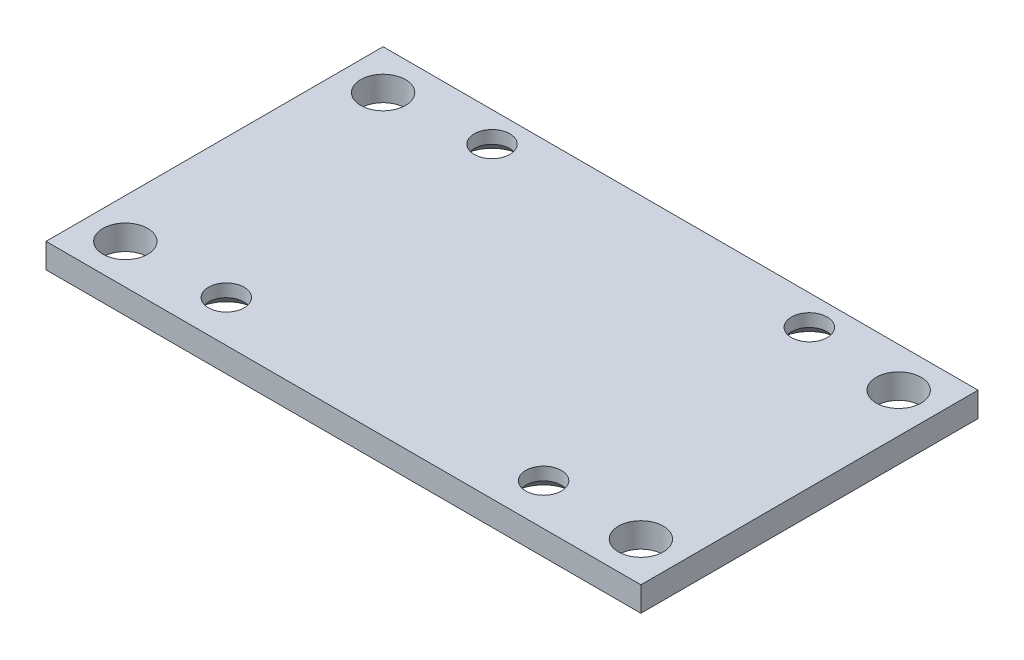
ISO-10303-21;
HEADER;
FILE_DESCRIPTION(('STEP AP214'),'2;1');
FILE_NAME('part.step','',(''),(''),'','','');
FILE_SCHEMA(('AUTOMOTIVE_DESIGN { 1 0 10303 214 1 1 1 1 }'));
ENDSEC;
DATA;
#1=APPLICATION_CONTEXT('core data for automotive mechanical design processes');
#2=APPLICATION_PROTOCOL_DEFINITION('international standard','automotive_design',2000,#1);
#3=PRODUCT_CONTEXT('',#1,'mechanical');
#4=PRODUCT('Part','Part','',(#3));
#5=PRODUCT_RELATED_PRODUCT_CATEGORY('part','',(#4));
#6=PRODUCT_DEFINITION_FORMATION('','',#4);
#7=PRODUCT_DEFINITION_CONTEXT('part definition',#1,'design');
#8=PRODUCT_DEFINITION('design','',#6,#7);
#9=PRODUCT_DEFINITION_SHAPE('','',#8);
#10=(LENGTH_UNIT() NAMED_UNIT(*) SI_UNIT(.MILLI.,.METRE.));
#11=(NAMED_UNIT(*) PLANE_ANGLE_UNIT() SI_UNIT($,.RADIAN.));
#12=(NAMED_UNIT(*) SI_UNIT($,.STERADIAN.) SOLID_ANGLE_UNIT());
#13=UNCERTAINTY_MEASURE_WITH_UNIT(LENGTH_MEASURE(1.E-05),#10,'distance_accuracy_value','');
#14=(GEOMETRIC_REPRESENTATION_CONTEXT(3) GLOBAL_UNCERTAINTY_ASSIGNED_CONTEXT((#13)) GLOBAL_UNIT_ASSIGNED_CONTEXT((#10,
#11,#12)) REPRESENTATION_CONTEXT('',''));
#15=CARTESIAN_POINT('',(0.,0.,0.));
#16=DIRECTION('',(0.,0.,1.));
#17=DIRECTION('',(1.,0.,0.));
#18=AXIS2_PLACEMENT_3D('',#15,#16,#17);
#19=CARTESIAN_POINT('',(15.,1.2446,8.5));
#20=DIRECTION('',(-1.,0.,0.));
#21=DIRECTION('',(0.,0.,1.));
#22=AXIS2_PLACEMENT_3D('',#19,#20,#21);
#23=PLANE('',#22);
#24=DIRECTION('',(0.,0.,-1.));
#25=VECTOR('',#24,1.);
#26=CARTESIAN_POINT('',(15.,0.,8.5));
#27=LINE('',#26,#25);
#28=CARTESIAN_POINT('',(15.,0.,8.5));
#29=VERTEX_POINT('',#28);
#30=CARTESIAN_POINT('',(15.,0.,-8.5));
#31=VERTEX_POINT('',#30);
#32=EDGE_CURVE('E98',#29,#31,#27,.T.);
#33=ORIENTED_EDGE('',*,*,#32,.T.);
#34=DIRECTION('',(0.,-1.,0.));
#35=VECTOR('',#34,1.);
#36=CARTESIAN_POINT('',(15.,1.2446,-8.5));
#37=LINE('',#36,#35);
#38=CARTESIAN_POINT('',(15.,1.2446,-8.5));
#39=VERTEX_POINT('',#38);
#40=EDGE_CURVE('E11',#39,#31,#37,.T.);
#41=ORIENTED_EDGE('',*,*,#40,.F.);
#42=DIRECTION('',(0.,0.,-1.));
#43=VECTOR('',#42,1.);
#44=CARTESIAN_POINT('',(15.,1.2446,8.5));
#45=LINE('',#44,#43);
#46=CARTESIAN_POINT('',(15.,1.2446,8.5));
#47=VERTEX_POINT('',#46);
#48=EDGE_CURVE('E85',#47,#39,#45,.T.);
#49=ORIENTED_EDGE('',*,*,#48,.F.);
#50=DIRECTION('',(0.,-1.,0.));
#51=VECTOR('',#50,1.);
#52=CARTESIAN_POINT('',(15.,1.2446,8.5));
#53=LINE('',#52,#51);
#54=EDGE_CURVE('E94',#47,#29,#53,.T.);
#55=ORIENTED_EDGE('',*,*,#54,.T.);
#56=EDGE_LOOP('',(#33,#41,#49,#55));
#57=FACE_BOUND('',#56,.T.);
#58=ADVANCED_FACE('F32',(#57),#23,.F.);
#59=CARTESIAN_POINT('',(-15.,1.2446,-8.5));
#60=DIRECTION('',(0.,0.,1.));
#61=DIRECTION('',(1.,0.,0.));
#62=AXIS2_PLACEMENT_3D('',#59,#60,#61);
#63=PLANE('',#62);
#64=DIRECTION('',(-1.,0.,0.));
#65=VECTOR('',#64,1.);
#66=CARTESIAN_POINT('',(-15.,0.,-8.5));
#67=LINE('',#66,#65);
#68=CARTESIAN_POINT('',(-15.,0.,-8.5));
#69=VERTEX_POINT('',#68);
#70=EDGE_CURVE('E89',#31,#69,#67,.T.);
#71=ORIENTED_EDGE('',*,*,#70,.T.);
#72=DIRECTION('',(0.,-1.,0.));
#73=VECTOR('',#72,1.);
#74=CARTESIAN_POINT('',(-15.,1.2446,-8.5));
#75=LINE('',#74,#73);
#76=CARTESIAN_POINT('',(-15.,1.2446,-8.5));
#77=VERTEX_POINT('',#76);
#78=EDGE_CURVE('E41',#77,#69,#75,.T.);
#79=ORIENTED_EDGE('',*,*,#78,.F.);
#80=DIRECTION('',(-1.,0.,0.));
#81=VECTOR('',#80,1.);
#82=CARTESIAN_POINT('',(-15.,1.2446,-8.5));
#83=LINE('',#82,#81);
#84=EDGE_CURVE('E80',#39,#77,#83,.T.);
#85=ORIENTED_EDGE('',*,*,#84,.F.);
#86=ORIENTED_EDGE('',*,*,#40,.T.);
#87=EDGE_LOOP('',(#71,#79,#85,#86));
#88=FACE_BOUND('',#87,.T.);
#89=ADVANCED_FACE('F88',(#88),#63,.F.);
#90=CARTESIAN_POINT('',(-15.,1.2446,8.5));
#91=DIRECTION('',(1.,0.,0.));
#92=DIRECTION('',(0.,0.,-1.));
#93=AXIS2_PLACEMENT_3D('',#90,#91,#92);
#94=PLANE('',#93);
#95=DIRECTION('',(0.,0.,1.));
#96=VECTOR('',#95,1.);
#97=CARTESIAN_POINT('',(-15.,0.,8.5));
#98=LINE('',#97,#96);
#99=CARTESIAN_POINT('',(-15.,0.,8.5));
#100=VERTEX_POINT('',#99);
#101=EDGE_CURVE('E67',#69,#100,#98,.T.);
#102=ORIENTED_EDGE('',*,*,#101,.T.);
#103=DIRECTION('',(0.,-1.,0.));
#104=VECTOR('',#103,1.);
#105=CARTESIAN_POINT('',(-15.,1.2446,8.5));
#106=LINE('',#105,#104);
#107=CARTESIAN_POINT('',(-15.,1.2446,8.5));
#108=VERTEX_POINT('',#107);
#109=EDGE_CURVE('E90',#108,#100,#106,.T.);
#110=ORIENTED_EDGE('',*,*,#109,.F.);
#111=DIRECTION('',(0.,0.,1.));
#112=VECTOR('',#111,1.);
#113=CARTESIAN_POINT('',(-15.,1.2446,8.5));
#114=LINE('',#113,#112);
#115=EDGE_CURVE('E83',#77,#108,#114,.T.);
#116=ORIENTED_EDGE('',*,*,#115,.F.);
#117=ORIENTED_EDGE('',*,*,#78,.T.);
#118=EDGE_LOOP('',(#102,#110,#116,#117));
#119=FACE_BOUND('',#118,.T.);
#120=ADVANCED_FACE('F92',(#119),#94,.F.);
#121=CARTESIAN_POINT('',(-15.,1.2446,8.5));
#122=DIRECTION('',(0.,0.,-1.));
#123=DIRECTION('',(-1.,0.,0.));
#124=AXIS2_PLACEMENT_3D('',#121,#122,#123);
#125=PLANE('',#124);
#126=DIRECTION('',(1.,0.,0.));
#127=VECTOR('',#126,1.);
#128=CARTESIAN_POINT('',(-15.,0.,8.5));
#129=LINE('',#128,#127);
#130=EDGE_CURVE('E73',#100,#29,#129,.T.);
#131=ORIENTED_EDGE('',*,*,#130,.T.);
#132=ORIENTED_EDGE('',*,*,#54,.F.);
#133=DIRECTION('',(1.,0.,0.));
#134=VECTOR('',#133,1.);
#135=CARTESIAN_POINT('',(-15.,1.2446,8.5));
#136=LINE('',#135,#134);
#137=EDGE_CURVE('E50',#108,#47,#136,.T.);
#138=ORIENTED_EDGE('',*,*,#137,.F.);
#139=ORIENTED_EDGE('',*,*,#109,.T.);
#140=EDGE_LOOP('',(#131,#132,#138,#139));
#141=FACE_BOUND('',#140,.T.);
#142=ADVANCED_FACE('F188',(#141),#125,.F.);
#143=CARTESIAN_POINT('',(15.,1.2446,-8.5));
#144=DIRECTION('',(0.,-1.,0.));
#145=DIRECTION('',(0.,0.,-1.));
#146=AXIS2_PLACEMENT_3D('',#143,#144,#145);
#147=PLANE('',#146);
#148=CARTESIAN_POINT('',(-12.9999999999998,1.2446,-6.50000000000001));
#149=DIRECTION('',(0.,1.,0.));
#150=DIRECTION('',(0.,0.,1.));
#151=AXIS2_PLACEMENT_3D('',#148,#149,#150);
#152=CIRCLE('',#151,1.1303);
#153=CARTESIAN_POINT('',(-12.9999999999998,1.2446,-5.36970000000001));
#154=VERTEX_POINT('',#153);
#155=EDGE_CURVE('E127',#154,#154,#152,.T.);
#156=ORIENTED_EDGE('',*,*,#155,.F.);
#157=EDGE_LOOP('',(#156));
#158=FACE_BOUND('',#157,.T.);
#159=CARTESIAN_POINT('',(-12.9999999999998,1.2446,6.5));
#160=DIRECTION('',(0.,1.,0.));
#161=DIRECTION('',(0.,0.,1.));
#162=AXIS2_PLACEMENT_3D('',#159,#160,#161);
#163=CIRCLE('',#162,1.1303);
#164=CARTESIAN_POINT('',(-12.9999999999998,1.2446,7.6303));
#165=VERTEX_POINT('',#164);
#166=EDGE_CURVE('E117',#165,#165,#163,.T.);
#167=ORIENTED_EDGE('',*,*,#166,.F.);
#168=EDGE_LOOP('',(#167));
#169=FACE_BOUND('',#168,.T.);
#170=CARTESIAN_POINT('',(12.9999999999999,1.2446,-6.5));
#171=DIRECTION('',(0.,1.,0.));
#172=DIRECTION('',(0.,0.,1.));
#173=AXIS2_PLACEMENT_3D('',#170,#171,#172);
#174=CIRCLE('',#173,1.1303);
#175=CARTESIAN_POINT('',(12.9999999999999,1.2446,-5.3697));
#176=VERTEX_POINT('',#175);
#177=EDGE_CURVE('E114',#176,#176,#174,.T.);
#178=ORIENTED_EDGE('',*,*,#177,.F.);
#179=EDGE_LOOP('',(#178));
#180=FACE_BOUND('',#179,.T.);
#181=CARTESIAN_POINT('',(12.9999999999999,1.2446,6.5));
#182=DIRECTION('',(0.,1.,0.));
#183=DIRECTION('',(0.,0.,1.));
#184=AXIS2_PLACEMENT_3D('',#181,#182,#183);
#185=CIRCLE('',#184,1.1303);
#186=CARTESIAN_POINT('',(12.9999999999999,1.2446,7.6303));
#187=VERTEX_POINT('',#186);
#188=EDGE_CURVE('E111',#187,#187,#185,.T.);
#189=ORIENTED_EDGE('',*,*,#188,.F.);
#190=EDGE_LOOP('',(#189));
#191=FACE_BOUND('',#190,.T.);
#192=CARTESIAN_POINT('',(-8.00000000000001,1.2446,6.40710452057659));
#193=DIRECTION('',(0.,-1.,0.));
#194=DIRECTION('',(0.,0.,-1.));
#195=AXIS2_PLACEMENT_3D('',#192,#193,#194);
#196=CIRCLE('',#195,0.9);
#197=CARTESIAN_POINT('',(-8.00000000000001,1.2446,5.50710452057659));
#198=VERTEX_POINT('',#197);
#199=EDGE_CURVE('E137',#198,#198,#196,.T.);
#200=ORIENTED_EDGE('',*,*,#199,.T.);
#201=EDGE_LOOP('',(#200));
#202=FACE_BOUND('',#201,.T.);
#203=CARTESIAN_POINT('',(7.9999999999999,1.2446,6.40710452057659));
#204=DIRECTION('',(0.,-1.,0.));
#205=DIRECTION('',(0.,0.,-1.));
#206=AXIS2_PLACEMENT_3D('',#203,#204,#205);
#207=CIRCLE('',#206,0.9);
#208=CARTESIAN_POINT('',(7.9999999999999,1.2446,5.50710452057659));
#209=VERTEX_POINT('',#208);
#210=EDGE_CURVE('E146',#209,#209,#207,.T.);
#211=ORIENTED_EDGE('',*,*,#210,.T.);
#212=EDGE_LOOP('',(#211));
#213=FACE_BOUND('',#212,.T.);
#214=CARTESIAN_POINT('',(-8.00000000000001,1.2446,-6.99289547942342));
#215=DIRECTION('',(0.,-1.,0.));
#216=DIRECTION('',(0.,0.,-1.));
#217=AXIS2_PLACEMENT_3D('',#214,#215,#216);
#218=CIRCLE('',#217,0.9);
#219=CARTESIAN_POINT('',(-8.00000000000001,1.2446,-7.89289547942342));
#220=VERTEX_POINT('',#219);
#221=EDGE_CURVE('E155',#220,#220,#218,.T.);
#222=ORIENTED_EDGE('',*,*,#221,.T.);
#223=EDGE_LOOP('',(#222));
#224=FACE_BOUND('',#223,.T.);
#225=CARTESIAN_POINT('',(7.9999999999999,1.2446,-6.99289547942342));
#226=DIRECTION('',(0.,-1.,0.));
#227=DIRECTION('',(0.,0.,-1.));
#228=AXIS2_PLACEMENT_3D('',#225,#226,#227);
#229=CIRCLE('',#228,0.9);
#230=CARTESIAN_POINT('',(7.9999999999999,1.2446,-7.89289547942342));
#231=VERTEX_POINT('',#230);
#232=EDGE_CURVE('E101',#231,#231,#229,.T.);
#233=ORIENTED_EDGE('',*,*,#232,.T.);
#234=EDGE_LOOP('',(#233));
#235=FACE_BOUND('',#234,.T.);
#236=ORIENTED_EDGE('',*,*,#48,.T.);
#237=ORIENTED_EDGE('',*,*,#84,.T.);
#238=ORIENTED_EDGE('',*,*,#115,.T.);
#239=ORIENTED_EDGE('',*,*,#137,.T.);
#240=EDGE_LOOP('',(#236,#237,#238,#239));
#241=FACE_BOUND('',#240,.T.);
#242=ADVANCED_FACE('F81',(#158,#169,#180,#191,#202,#213,#224,#235,#241),#147,.F.);
#243=CARTESIAN_POINT('',(15.,0.,-8.5));
#244=DIRECTION('',(0.,-1.,0.));
#245=DIRECTION('',(0.,0.,-1.));
#246=AXIS2_PLACEMENT_3D('',#243,#244,#245);
#247=PLANE('',#246);
#248=CARTESIAN_POINT('',(-12.9999999999998,0.,-6.50000000000001));
#249=DIRECTION('',(0.,-1.,0.));
#250=DIRECTION('',(0.,0.,-1.));
#251=AXIS2_PLACEMENT_3D('',#248,#249,#250);
#252=CIRCLE('',#251,1.1303);
#253=CARTESIAN_POINT('',(-12.9999999999998,0.,-7.6303));
#254=VERTEX_POINT('',#253);
#255=EDGE_CURVE('E35',#254,#254,#252,.T.);
#256=ORIENTED_EDGE('',*,*,#255,.F.);
#257=EDGE_LOOP('',(#256));
#258=FACE_BOUND('',#257,.T.);
#259=CARTESIAN_POINT('',(-12.9999999999998,0.,6.5));
#260=DIRECTION('',(0.,-1.,0.));
#261=DIRECTION('',(0.,0.,-1.));
#262=AXIS2_PLACEMENT_3D('',#259,#260,#261);
#263=CIRCLE('',#262,1.1303);
#264=CARTESIAN_POINT('',(-12.9999999999998,0.,5.3697));
#265=VERTEX_POINT('',#264);
#266=EDGE_CURVE('E115',#265,#265,#263,.T.);
#267=ORIENTED_EDGE('',*,*,#266,.F.);
#268=EDGE_LOOP('',(#267));
#269=FACE_BOUND('',#268,.T.);
#270=CARTESIAN_POINT('',(12.9999999999999,0.,-6.5));
#271=DIRECTION('',(0.,-1.,0.));
#272=DIRECTION('',(0.,0.,-1.));
#273=AXIS2_PLACEMENT_3D('',#270,#271,#272);
#274=CIRCLE('',#273,1.1303);
#275=CARTESIAN_POINT('',(12.9999999999999,0.,-7.6303));
#276=VERTEX_POINT('',#275);
#277=EDGE_CURVE('E112',#276,#276,#274,.T.);
#278=ORIENTED_EDGE('',*,*,#277,.F.);
#279=EDGE_LOOP('',(#278));
#280=FACE_BOUND('',#279,.T.);
#281=CARTESIAN_POINT('',(12.9999999999999,0.,6.5));
#282=DIRECTION('',(0.,-1.,0.));
#283=DIRECTION('',(0.,0.,-1.));
#284=AXIS2_PLACEMENT_3D('',#281,#282,#283);
#285=CIRCLE('',#284,1.1303);
#286=CARTESIAN_POINT('',(12.9999999999999,0.,5.3697));
#287=VERTEX_POINT('',#286);
#288=EDGE_CURVE('E107',#287,#287,#285,.T.);
#289=ORIENTED_EDGE('',*,*,#288,.F.);
#290=EDGE_LOOP('',(#289));
#291=FACE_BOUND('',#290,.T.);
#292=CARTESIAN_POINT('',(-8.00000000000001,0.,6.40710452057659));
#293=DIRECTION('',(0.,-1.,0.));
#294=DIRECTION('',(0.,0.,-1.));
#295=AXIS2_PLACEMENT_3D('',#292,#293,#294);
#296=CIRCLE('',#295,1.5);
#297=CARTESIAN_POINT('',(-8.00000000000001,0.,4.90710452057659));
#298=VERTEX_POINT('',#297);
#299=EDGE_CURVE('E110',#298,#298,#296,.T.);
#300=ORIENTED_EDGE('',*,*,#299,.F.);
#301=EDGE_LOOP('',(#300));
#302=FACE_BOUND('',#301,.T.);
#303=CARTESIAN_POINT('',(7.9999999999999,0.,6.40710452057659));
#304=DIRECTION('',(0.,-1.,0.));
#305=DIRECTION('',(0.,0.,-1.));
#306=AXIS2_PLACEMENT_3D('',#303,#304,#305);
#307=CIRCLE('',#306,1.5);
#308=CARTESIAN_POINT('',(7.9999999999999,0.,4.90710452057659));
#309=VERTEX_POINT('',#308);
#310=EDGE_CURVE('E140',#309,#309,#307,.T.);
#311=ORIENTED_EDGE('',*,*,#310,.F.);
#312=EDGE_LOOP('',(#311));
#313=FACE_BOUND('',#312,.T.);
#314=CARTESIAN_POINT('',(-8.00000000000001,0.,-6.99289547942342));
#315=DIRECTION('',(0.,-1.,0.));
#316=DIRECTION('',(0.,0.,-1.));
#317=AXIS2_PLACEMENT_3D('',#314,#315,#316);
#318=CIRCLE('',#317,1.5);
#319=CARTESIAN_POINT('',(-8.00000000000001,0.,-8.49289547942342));
#320=VERTEX_POINT('',#319);
#321=EDGE_CURVE('E149',#320,#320,#318,.T.);
#322=ORIENTED_EDGE('',*,*,#321,.F.);
#323=EDGE_LOOP('',(#322));
#324=FACE_BOUND('',#323,.T.);
#325=CARTESIAN_POINT('',(7.9999999999999,0.,-6.99289547942342));
#326=DIRECTION('',(0.,-1.,0.));
#327=DIRECTION('',(0.,0.,-1.));
#328=AXIS2_PLACEMENT_3D('',#325,#326,#327);
#329=CIRCLE('',#328,1.5);
#330=CARTESIAN_POINT('',(7.9999999999999,0.,-8.49289547942342));
#331=VERTEX_POINT('',#330);
#332=EDGE_CURVE('E158',#331,#331,#329,.T.);
#333=ORIENTED_EDGE('',*,*,#332,.F.);
#334=EDGE_LOOP('',(#333));
#335=FACE_BOUND('',#334,.T.);
#336=ORIENTED_EDGE('',*,*,#32,.F.);
#337=ORIENTED_EDGE('',*,*,#130,.F.);
#338=ORIENTED_EDGE('',*,*,#101,.F.);
#339=ORIENTED_EDGE('',*,*,#70,.F.);
#340=EDGE_LOOP('',(#336,#337,#338,#339));
#341=FACE_BOUND('',#340,.T.);
#342=ADVANCED_FACE('F172',(#258,#269,#280,#291,#302,#313,#324,#335,#341),#247,.T.);
#343=CARTESIAN_POINT('',(7.9999999999999,0.,-6.99289547942342));
#344=DIRECTION('',(0.,-1.,0.));
#345=DIRECTION('',(0.,0.,-1.));
#346=AXIS2_PLACEMENT_3D('',#343,#344,#345);
#347=CYLINDRICAL_SURFACE('',#346,0.9);
#348=ORIENTED_EDGE('',*,*,#232,.F.);
#349=EDGE_LOOP('',(#348));
#350=FACE_BOUND('',#349,.T.);
#351=CARTESIAN_POINT('',(7.9999999999999,0.599999999999999,-6.99289547942342));
#352=DIRECTION('',(0.,-1.,0.));
#353=DIRECTION('',(0.,0.,-1.));
#354=AXIS2_PLACEMENT_3D('',#351,#352,#353);
#355=CIRCLE('',#354,0.9);
#356=CARTESIAN_POINT('',(7.9999999999999,0.599999999999999,-7.89289547942342));
#357=VERTEX_POINT('',#356);
#358=EDGE_CURVE('E161',#357,#357,#355,.T.);
#359=ORIENTED_EDGE('',*,*,#358,.T.);
#360=EDGE_LOOP('',(#359));
#361=FACE_BOUND('',#360,.T.);
#362=ADVANCED_FACE('F168',(#350,#361),#347,.F.);
#363=CARTESIAN_POINT('',(7.9999999999999,0.,-6.99289547942342));
#364=DIRECTION('',(0.,-1.,0.));
#365=DIRECTION('',(0.,0.,-1.));
#366=AXIS2_PLACEMENT_3D('',#363,#364,#365);
#367=CONICAL_SURFACE('',#366,1.5,0.785398163397449);
#368=ORIENTED_EDGE('',*,*,#358,.F.);
#369=EDGE_LOOP('',(#368));
#370=FACE_BOUND('',#369,.T.);
#371=ORIENTED_EDGE('',*,*,#332,.T.);
#372=EDGE_LOOP('',(#371));
#373=FACE_BOUND('',#372,.T.);
#374=ADVANCED_FACE('F171',(#370,#373),#367,.F.);
#375=CARTESIAN_POINT('',(-8.00000000000001,0.,-6.99289547942342));
#376=DIRECTION('',(0.,-1.,0.));
#377=DIRECTION('',(0.,0.,-1.));
#378=AXIS2_PLACEMENT_3D('',#375,#376,#377);
#379=CYLINDRICAL_SURFACE('',#378,0.9);
#380=ORIENTED_EDGE('',*,*,#221,.F.);
#381=EDGE_LOOP('',(#380));
#382=FACE_BOUND('',#381,.T.);
#383=CARTESIAN_POINT('',(-8.00000000000001,0.599999999999999,-6.99289547942342));
#384=DIRECTION('',(0.,-1.,0.));
#385=DIRECTION('',(0.,0.,-1.));
#386=AXIS2_PLACEMENT_3D('',#383,#384,#385);
#387=CIRCLE('',#386,0.9);
#388=CARTESIAN_POINT('',(-8.00000000000001,0.599999999999999,-7.89289547942342));
#389=VERTEX_POINT('',#388);
#390=EDGE_CURVE('E152',#389,#389,#387,.T.);
#391=ORIENTED_EDGE('',*,*,#390,.T.);
#392=EDGE_LOOP('',(#391));
#393=FACE_BOUND('',#392,.T.);
#394=ADVANCED_FACE('F178',(#382,#393),#379,.F.);
#395=CARTESIAN_POINT('',(-8.00000000000001,0.,-6.99289547942342));
#396=DIRECTION('',(0.,-1.,0.));
#397=DIRECTION('',(0.,0.,-1.));
#398=AXIS2_PLACEMENT_3D('',#395,#396,#397);
#399=CONICAL_SURFACE('',#398,1.5,0.785398163397449);
#400=ORIENTED_EDGE('',*,*,#390,.F.);
#401=EDGE_LOOP('',(#400));
#402=FACE_BOUND('',#401,.T.);
#403=ORIENTED_EDGE('',*,*,#321,.T.);
#404=EDGE_LOOP('',(#403));
#405=FACE_BOUND('',#404,.T.);
#406=ADVANCED_FACE('F235',(#402,#405),#399,.F.);
#407=CARTESIAN_POINT('',(7.9999999999999,0.,6.40710452057659));
#408=DIRECTION('',(0.,-1.,0.));
#409=DIRECTION('',(0.,0.,-1.));
#410=AXIS2_PLACEMENT_3D('',#407,#408,#409);
#411=CYLINDRICAL_SURFACE('',#410,0.9);
#412=ORIENTED_EDGE('',*,*,#210,.F.);
#413=EDGE_LOOP('',(#412));
#414=FACE_BOUND('',#413,.T.);
#415=CARTESIAN_POINT('',(7.9999999999999,0.599999999999999,6.40710452057659));
#416=DIRECTION('',(0.,-1.,0.));
#417=DIRECTION('',(0.,0.,-1.));
#418=AXIS2_PLACEMENT_3D('',#415,#416,#417);
#419=CIRCLE('',#418,0.9);
#420=CARTESIAN_POINT('',(7.9999999999999,0.599999999999999,5.50710452057659));
#421=VERTEX_POINT('',#420);
#422=EDGE_CURVE('E143',#421,#421,#419,.T.);
#423=ORIENTED_EDGE('',*,*,#422,.T.);
#424=EDGE_LOOP('',(#423));
#425=FACE_BOUND('',#424,.T.);
#426=ADVANCED_FACE('F245',(#414,#425),#411,.F.);
#427=CARTESIAN_POINT('',(7.9999999999999,0.,6.40710452057659));
#428=DIRECTION('',(0.,-1.,0.));
#429=DIRECTION('',(0.,0.,-1.));
#430=AXIS2_PLACEMENT_3D('',#427,#428,#429);
#431=CONICAL_SURFACE('',#430,1.5,0.785398163397449);
#432=ORIENTED_EDGE('',*,*,#422,.F.);
#433=EDGE_LOOP('',(#432));
#434=FACE_BOUND('',#433,.T.);
#435=ORIENTED_EDGE('',*,*,#310,.T.);
#436=EDGE_LOOP('',(#435));
#437=FACE_BOUND('',#436,.T.);
#438=ADVANCED_FACE('F255',(#434,#437),#431,.F.);
#439=CARTESIAN_POINT('',(-8.00000000000001,0.,6.40710452057659));
#440=DIRECTION('',(0.,-1.,0.));
#441=DIRECTION('',(0.,0.,-1.));
#442=AXIS2_PLACEMENT_3D('',#439,#440,#441);
#443=CYLINDRICAL_SURFACE('',#442,0.9);
#444=ORIENTED_EDGE('',*,*,#199,.F.);
#445=EDGE_LOOP('',(#444));
#446=FACE_BOUND('',#445,.T.);
#447=CARTESIAN_POINT('',(-8.00000000000001,0.599999999999999,6.40710452057659));
#448=DIRECTION('',(0.,-1.,0.));
#449=DIRECTION('',(0.,0.,-1.));
#450=AXIS2_PLACEMENT_3D('',#447,#448,#449);
#451=CIRCLE('',#450,0.9);
#452=CARTESIAN_POINT('',(-8.00000000000001,0.599999999999999,5.50710452057659));
#453=VERTEX_POINT('',#452);
#454=EDGE_CURVE('E134',#453,#453,#451,.T.);
#455=ORIENTED_EDGE('',*,*,#454,.T.);
#456=EDGE_LOOP('',(#455));
#457=FACE_BOUND('',#456,.T.);
#458=ADVANCED_FACE('F265',(#446,#457),#443,.F.);
#459=CARTESIAN_POINT('',(-8.00000000000001,0.,6.40710452057659));
#460=DIRECTION('',(0.,-1.,0.));
#461=DIRECTION('',(0.,0.,-1.));
#462=AXIS2_PLACEMENT_3D('',#459,#460,#461);
#463=CONICAL_SURFACE('',#462,1.5,0.785398163397449);
#464=ORIENTED_EDGE('',*,*,#454,.F.);
#465=EDGE_LOOP('',(#464));
#466=FACE_BOUND('',#465,.T.);
#467=ORIENTED_EDGE('',*,*,#299,.T.);
#468=EDGE_LOOP('',(#467));
#469=FACE_BOUND('',#468,.T.);
#470=ADVANCED_FACE('F275',(#466,#469),#463,.F.);
#471=CARTESIAN_POINT('',(12.9999999999999,1.2446,6.5));
#472=DIRECTION('',(0.,1.,0.));
#473=DIRECTION('',(0.,0.,1.));
#474=AXIS2_PLACEMENT_3D('',#471,#472,#473);
#475=CYLINDRICAL_SURFACE('',#474,1.1303);
#476=ORIENTED_EDGE('',*,*,#288,.T.);
#477=EDGE_LOOP('',(#476));
#478=FACE_BOUND('',#477,.T.);
#479=ORIENTED_EDGE('',*,*,#188,.T.);
#480=EDGE_LOOP('',(#479));
#481=FACE_BOUND('',#480,.T.);
#482=ADVANCED_FACE('F285',(#478,#481),#475,.F.);
#483=CARTESIAN_POINT('',(12.9999999999999,1.2446,-6.5));
#484=DIRECTION('',(0.,1.,0.));
#485=DIRECTION('',(0.,0.,1.));
#486=AXIS2_PLACEMENT_3D('',#483,#484,#485);
#487=CYLINDRICAL_SURFACE('',#486,1.1303);
#488=ORIENTED_EDGE('',*,*,#277,.T.);
#489=EDGE_LOOP('',(#488));
#490=FACE_BOUND('',#489,.T.);
#491=ORIENTED_EDGE('',*,*,#177,.T.);
#492=EDGE_LOOP('',(#491));
#493=FACE_BOUND('',#492,.T.);
#494=ADVANCED_FACE('F305',(#490,#493),#487,.F.);
#495=CARTESIAN_POINT('',(-12.9999999999998,1.2446,6.5));
#496=DIRECTION('',(0.,1.,0.));
#497=DIRECTION('',(0.,0.,1.));
#498=AXIS2_PLACEMENT_3D('',#495,#496,#497);
#499=CYLINDRICAL_SURFACE('',#498,1.1303);
#500=ORIENTED_EDGE('',*,*,#266,.T.);
#501=EDGE_LOOP('',(#500));
#502=FACE_BOUND('',#501,.T.);
#503=ORIENTED_EDGE('',*,*,#166,.T.);
#504=EDGE_LOOP('',(#503));
#505=FACE_BOUND('',#504,.T.);
#506=ADVANCED_FACE('F315',(#502,#505),#499,.F.);
#507=CARTESIAN_POINT('',(-12.9999999999998,1.2446,-6.50000000000001));
#508=DIRECTION('',(0.,1.,0.));
#509=DIRECTION('',(0.,0.,1.));
#510=AXIS2_PLACEMENT_3D('',#507,#508,#509);
#511=CYLINDRICAL_SURFACE('',#510,1.1303);
#512=ORIENTED_EDGE('',*,*,#255,.T.);
#513=EDGE_LOOP('',(#512));
#514=FACE_BOUND('',#513,.T.);
#515=ORIENTED_EDGE('',*,*,#155,.T.);
#516=EDGE_LOOP('',(#515));
#517=FACE_BOUND('',#516,.T.);
#518=ADVANCED_FACE('F325',(#514,#517),#511,.F.);
#519=CLOSED_SHELL('',(#58,#89,#120,#142,#242,#342,#362,#374,#394,#406,#426,#438,#458,#470,#482,
#494,#506,#518));
#520=MANIFOLD_SOLID_BREP('B2',#519);
#521=ADVANCED_BREP_SHAPE_REPRESENTATION('',(#18,#520),#14);
#522=SHAPE_DEFINITION_REPRESENTATION(#9,#521);
ENDSEC;
END-ISO-10303-21;
